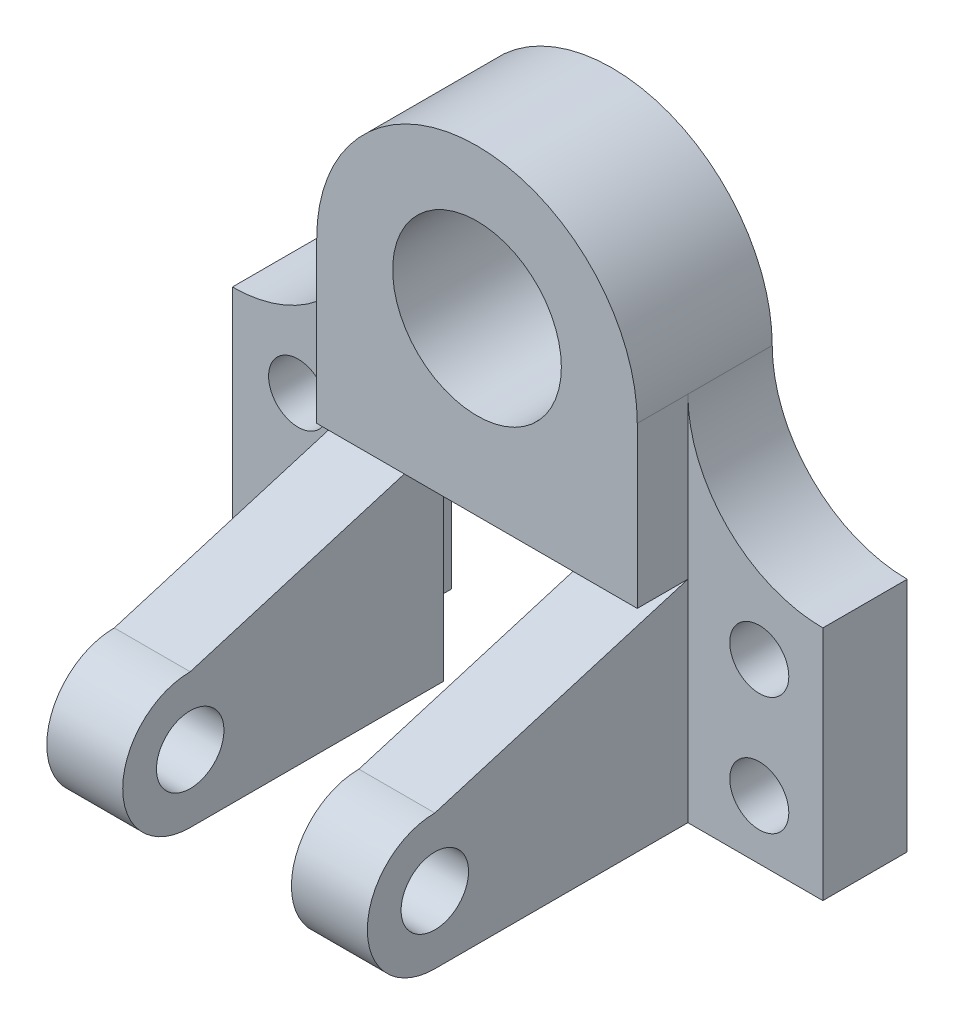
ISO-10303-21;
HEADER;
FILE_DESCRIPTION(('STEP AP214'),'2;1');
FILE_NAME('part.step','',(''),(''),'','','');
FILE_SCHEMA(('AUTOMOTIVE_DESIGN { 1 0 10303 214 1 1 1 1 }'));
ENDSEC;
DATA;
#1=APPLICATION_CONTEXT('core data for automotive mechanical design processes');
#2=APPLICATION_PROTOCOL_DEFINITION('international standard','automotive_design',2000,#1);
#3=PRODUCT_CONTEXT('',#1,'mechanical');
#4=PRODUCT('Part','Part','',(#3));
#5=PRODUCT_RELATED_PRODUCT_CATEGORY('part','',(#4));
#6=PRODUCT_DEFINITION_FORMATION('','',#4);
#7=PRODUCT_DEFINITION_CONTEXT('part definition',#1,'design');
#8=PRODUCT_DEFINITION('design','',#6,#7);
#9=PRODUCT_DEFINITION_SHAPE('','',#8);
#10=(LENGTH_UNIT() NAMED_UNIT(*) SI_UNIT(.MILLI.,.METRE.));
#11=(NAMED_UNIT(*) PLANE_ANGLE_UNIT() SI_UNIT($,.RADIAN.));
#12=(NAMED_UNIT(*) SI_UNIT($,.STERADIAN.) SOLID_ANGLE_UNIT());
#13=UNCERTAINTY_MEASURE_WITH_UNIT(LENGTH_MEASURE(1.E-05),#10,'distance_accuracy_value','');
#14=(GEOMETRIC_REPRESENTATION_CONTEXT(3) GLOBAL_UNCERTAINTY_ASSIGNED_CONTEXT((#13)) GLOBAL_UNIT_ASSIGNED_CONTEXT((#10,
#11,#12)) REPRESENTATION_CONTEXT('',''));
#15=CARTESIAN_POINT('',(0.,0.,0.));
#16=DIRECTION('',(0.,0.,1.));
#17=DIRECTION('',(1.,0.,0.));
#18=AXIS2_PLACEMENT_3D('',#15,#16,#17);
#19=CARTESIAN_POINT('',(20.,0.,20.));
#20=DIRECTION('',(0.,0.,1.));
#21=DIRECTION('',(1.,0.,0.));
#22=AXIS2_PLACEMENT_3D('',#19,#20,#21);
#23=PLANE('',#22);
#24=DIRECTION('',(0.,-1.,0.));
#25=VECTOR('',#24,1.);
#26=CARTESIAN_POINT('',(38.,0.,20.));
#27=LINE('',#26,#25);
#28=CARTESIAN_POINT('',(38.,0.,20.));
#29=VERTEX_POINT('',#28);
#30=CARTESIAN_POINT('',(38.,-50.,20.));
#31=VERTEX_POINT('',#30);
#32=EDGE_CURVE('E111',#29,#31,#27,.T.);
#33=ORIENTED_EDGE('',*,*,#32,.T.);
#34=DIRECTION('',(1.,0.,0.));
#35=VECTOR('',#34,1.);
#36=CARTESIAN_POINT('',(20.,-50.,20.));
#37=LINE('',#36,#35);
#38=CARTESIAN_POINT('',(20.,-50.,20.));
#39=VERTEX_POINT('',#38);
#40=EDGE_CURVE('E12',#39,#31,#37,.T.);
#41=ORIENTED_EDGE('',*,*,#40,.F.);
#42=DIRECTION('',(0.,-1.,0.));
#43=VECTOR('',#42,1.);
#44=CARTESIAN_POINT('',(20.,0.,20.));
#45=LINE('',#44,#43);
#46=CARTESIAN_POINT('',(20.,0.,20.));
#47=VERTEX_POINT('',#46);
#48=EDGE_CURVE('E98',#47,#39,#45,.T.);
#49=ORIENTED_EDGE('',*,*,#48,.F.);
#50=DIRECTION('',(1.,0.,0.));
#51=VECTOR('',#50,1.);
#52=CARTESIAN_POINT('',(20.,0.,20.));
#53=LINE('',#52,#51);
#54=EDGE_CURVE('E107',#47,#29,#53,.T.);
#55=ORIENTED_EDGE('',*,*,#54,.T.);
#56=EDGE_LOOP('',(#33,#41,#49,#55));
#57=FACE_BOUND('',#56,.T.);
#58=ADVANCED_FACE('F46',(#57),#23,.F.);
#59=CARTESIAN_POINT('',(20.,-50.,20.));
#60=DIRECTION('',(0.,1.,0.));
#61=DIRECTION('',(0.,0.,1.));
#62=AXIS2_PLACEMENT_3D('',#59,#60,#61);
#63=PLANE('',#62);
#64=DIRECTION('',(0.,0.,1.));
#65=VECTOR('',#64,1.);
#66=CARTESIAN_POINT('',(38.,-50.,20.));
#67=LINE('',#66,#65);
#68=CARTESIAN_POINT('',(38.,-50.,80.));
#69=VERTEX_POINT('',#68);
#70=EDGE_CURVE('E102',#31,#69,#67,.T.);
#71=ORIENTED_EDGE('',*,*,#70,.T.);
#72=DIRECTION('',(1.,0.,0.));
#73=VECTOR('',#72,1.);
#74=CARTESIAN_POINT('',(20.,-50.,80.));
#75=LINE('',#74,#73);
#76=CARTESIAN_POINT('',(20.,-50.,80.));
#77=VERTEX_POINT('',#76);
#78=EDGE_CURVE('E55',#77,#69,#75,.T.);
#79=ORIENTED_EDGE('',*,*,#78,.F.);
#80=DIRECTION('',(0.,0.,1.));
#81=VECTOR('',#80,1.);
#82=CARTESIAN_POINT('',(20.,-50.,20.));
#83=LINE('',#82,#81);
#84=EDGE_CURVE('E93',#39,#77,#83,.T.);
#85=ORIENTED_EDGE('',*,*,#84,.F.);
#86=ORIENTED_EDGE('',*,*,#40,.T.);
#87=EDGE_LOOP('',(#71,#79,#85,#86));
#88=FACE_BOUND('',#87,.T.);
#89=ADVANCED_FACE('F101',(#88),#63,.F.);
#90=CARTESIAN_POINT('',(20.,-34.,80.));
#91=DIRECTION('',(1.,0.,0.));
#92=DIRECTION('',(0.,0.,-1.));
#93=AXIS2_PLACEMENT_3D('',#90,#91,#92);
#94=CYLINDRICAL_SURFACE('',#93,16.);
#95=CARTESIAN_POINT('',(38.,-34.,80.));
#96=DIRECTION('',(-1.,0.,0.));
#97=DIRECTION('',(0.,0.,1.));
#98=AXIS2_PLACEMENT_3D('',#95,#96,#97);
#99=CIRCLE('',#98,16.);
#100=CARTESIAN_POINT('',(38.,-18.,80.));
#101=VERTEX_POINT('',#100);
#102=EDGE_CURVE('E80',#69,#101,#99,.T.);
#103=ORIENTED_EDGE('',*,*,#102,.T.);
#104=DIRECTION('',(1.,0.,0.));
#105=VECTOR('',#104,1.);
#106=CARTESIAN_POINT('',(20.,-18.,80.));
#107=LINE('',#106,#105);
#108=CARTESIAN_POINT('',(20.,-18.,80.));
#109=VERTEX_POINT('',#108);
#110=EDGE_CURVE('E103',#109,#101,#107,.T.);
#111=ORIENTED_EDGE('',*,*,#110,.F.);
#112=CARTESIAN_POINT('',(20.,-34.,80.));
#113=DIRECTION('',(-1.,0.,0.));
#114=DIRECTION('',(0.,0.,1.));
#115=AXIS2_PLACEMENT_3D('',#112,#113,#114);
#116=CIRCLE('',#115,16.);
#117=EDGE_CURVE('E96',#77,#109,#116,.T.);
#118=ORIENTED_EDGE('',*,*,#117,.F.);
#119=ORIENTED_EDGE('',*,*,#78,.T.);
#120=EDGE_LOOP('',(#103,#111,#118,#119));
#121=FACE_BOUND('',#120,.T.);
#122=ADVANCED_FACE('F105',(#121),#94,.T.);
#123=CARTESIAN_POINT('',(20.,0.,20.));
#124=DIRECTION('',(0.,-0.957826285221151,-0.287347885566346));
#125=DIRECTION('',(0.,0.287347885566346,-0.957826285221152));
#126=AXIS2_PLACEMENT_3D('',#123,#124,#125);
#127=PLANE('',#126);
#128=DIRECTION('',(0.,0.287347885566346,-0.957826285221151));
#129=VECTOR('',#128,1.);
#130=CARTESIAN_POINT('',(38.,0.,20.));
#131=LINE('',#130,#129);
#132=EDGE_CURVE('E86',#101,#29,#131,.T.);
#133=ORIENTED_EDGE('',*,*,#132,.T.);
#134=ORIENTED_EDGE('',*,*,#54,.F.);
#135=DIRECTION('',(0.,0.287347885566346,-0.957826285221151));
#136=VECTOR('',#135,1.);
#137=CARTESIAN_POINT('',(20.,0.,20.));
#138=LINE('',#137,#136);
#139=EDGE_CURVE('E63',#109,#47,#138,.T.);
#140=ORIENTED_EDGE('',*,*,#139,.F.);
#141=ORIENTED_EDGE('',*,*,#110,.T.);
#142=EDGE_LOOP('',(#133,#134,#140,#141));
#143=FACE_BOUND('',#142,.T.);
#144=ADVANCED_FACE('F119',(#143),#127,.F.);
#145=CARTESIAN_POINT('',(20.,-34.,80.));
#146=DIRECTION('',(-1.,0.,0.));
#147=DIRECTION('',(0.,0.,1.));
#148=AXIS2_PLACEMENT_3D('',#145,#146,#147);
#149=PLANE('',#148);
#150=CARTESIAN_POINT('',(20.,-33.9996164173377,80.));
#151=DIRECTION('',(-1.,0.,0.));
#152=DIRECTION('',(0.,0.,1.));
#153=AXIS2_PLACEMENT_3D('',#150,#151,#152);
#154=CIRCLE('',#153,8.00000000000001);
#155=CARTESIAN_POINT('',(20.,-33.9996164173377,88.));
#156=VERTEX_POINT('',#155);
#157=EDGE_CURVE('E114',#156,#156,#154,.T.);
#158=ORIENTED_EDGE('',*,*,#157,.F.);
#159=EDGE_LOOP('',(#158));
#160=FACE_BOUND('',#159,.T.);
#161=ORIENTED_EDGE('',*,*,#48,.T.);
#162=ORIENTED_EDGE('',*,*,#84,.T.);
#163=ORIENTED_EDGE('',*,*,#117,.T.);
#164=ORIENTED_EDGE('',*,*,#139,.T.);
#165=EDGE_LOOP('',(#161,#162,#163,#164));
#166=FACE_BOUND('',#165,.T.);
#167=ADVANCED_FACE('F94',(#160,#166),#149,.T.);
#168=CARTESIAN_POINT('',(38.,-34.,80.));
#169=DIRECTION('',(-1.,0.,0.));
#170=DIRECTION('',(0.,0.,1.));
#171=AXIS2_PLACEMENT_3D('',#168,#169,#170);
#172=PLANE('',#171);
#173=CARTESIAN_POINT('',(38.,-33.9996164173377,80.));
#174=DIRECTION('',(-1.,0.,0.));
#175=DIRECTION('',(0.,0.,1.));
#176=AXIS2_PLACEMENT_3D('',#173,#174,#175);
#177=CIRCLE('',#176,8.00000000000001);
#178=CARTESIAN_POINT('',(38.,-33.9996164173377,88.));
#179=VERTEX_POINT('',#178);
#180=EDGE_CURVE('E49',#179,#179,#177,.T.);
#181=ORIENTED_EDGE('',*,*,#180,.T.);
#182=EDGE_LOOP('',(#181));
#183=FACE_BOUND('',#182,.T.);
#184=ORIENTED_EDGE('',*,*,#32,.F.);
#185=ORIENTED_EDGE('',*,*,#132,.F.);
#186=ORIENTED_EDGE('',*,*,#102,.F.);
#187=ORIENTED_EDGE('',*,*,#70,.F.);
#188=EDGE_LOOP('',(#184,#185,#186,#187));
#189=FACE_BOUND('',#188,.T.);
#190=ADVANCED_FACE('F122',(#183,#189),#172,.F.);
#191=CARTESIAN_POINT('',(70.0000000000001,-33.9996164173376,80.));
#192=DIRECTION('',(-1.,0.,0.));
#193=DIRECTION('',(0.,-1.,0.));
#194=AXIS2_PLACEMENT_3D('',#191,#192,#193);
#195=CYLINDRICAL_SURFACE('',#194,8.00000000000001);
#196=ORIENTED_EDGE('',*,*,#157,.T.);
#197=EDGE_LOOP('',(#196));
#198=FACE_BOUND('',#197,.T.);
#199=ORIENTED_EDGE('',*,*,#180,.F.);
#200=EDGE_LOOP('',(#199));
#201=FACE_BOUND('',#200,.T.);
#202=ADVANCED_FACE('F132',(#198,#201),#195,.F.);
#203=CLOSED_SHELL('',(#58,#89,#122,#144,#167,#190,#202));
#204=MANIFOLD_SOLID_BREP('B2',#203);
#205=CARTESIAN_POINT('',(-20.,0.,20.));
#206=DIRECTION('',(0.,0.,1.));
#207=DIRECTION('',(0.,-1.,0.));
#208=AXIS2_PLACEMENT_3D('',#205,#206,#207);
#209=PLANE('',#208);
#210=DIRECTION('',(0.,1.,0.));
#211=VECTOR('',#210,1.);
#212=CARTESIAN_POINT('',(-38.,0.,20.));
#213=LINE('',#212,#211);
#214=CARTESIAN_POINT('',(-38.,-50.,20.));
#215=VERTEX_POINT('',#214);
#216=CARTESIAN_POINT('',(-38.,0.,20.));
#217=VERTEX_POINT('',#216);
#218=EDGE_CURVE('E263',#215,#217,#213,.T.);
#219=ORIENTED_EDGE('',*,*,#218,.T.);
#220=DIRECTION('',(-1.,0.,0.));
#221=VECTOR('',#220,1.);
#222=CARTESIAN_POINT('',(-20.,0.,20.));
#223=LINE('',#222,#221);
#224=CARTESIAN_POINT('',(-20.,0.,20.));
#225=VERTEX_POINT('',#224);
#226=EDGE_CURVE('E44',#225,#217,#223,.T.);
#227=ORIENTED_EDGE('',*,*,#226,.F.);
#228=DIRECTION('',(0.,1.,0.));
#229=VECTOR('',#228,1.);
#230=CARTESIAN_POINT('',(-20.,0.,20.));
#231=LINE('',#230,#229);
#232=CARTESIAN_POINT('',(-20.,-50.,20.));
#233=VERTEX_POINT('',#232);
#234=EDGE_CURVE('E251',#233,#225,#231,.T.);
#235=ORIENTED_EDGE('',*,*,#234,.F.);
#236=DIRECTION('',(-1.,0.,0.));
#237=VECTOR('',#236,1.);
#238=CARTESIAN_POINT('',(-20.,-50.,20.));
#239=LINE('',#238,#237);
#240=EDGE_CURVE('E259',#233,#215,#239,.T.);
#241=ORIENTED_EDGE('',*,*,#240,.T.);
#242=EDGE_LOOP('',(#219,#227,#235,#241));
#243=FACE_BOUND('',#242,.T.);
#244=ADVANCED_FACE('F200',(#243),#209,.F.);
#245=CARTESIAN_POINT('',(-20.,-18.,80.));
#246=DIRECTION('',(0.,-0.957826285221151,-0.287347885566346));
#247=DIRECTION('',(0.,0.287347885566346,-0.957826285221152));
#248=AXIS2_PLACEMENT_3D('',#245,#246,#247);
#249=PLANE('',#248);
#250=DIRECTION('',(0.,-0.287347885566346,0.957826285221151));
#251=VECTOR('',#250,1.);
#252=CARTESIAN_POINT('',(-38.,-18.,80.));
#253=LINE('',#252,#251);
#254=CARTESIAN_POINT('',(-38.,-18.,80.));
#255=VERTEX_POINT('',#254);
#256=EDGE_CURVE('E255',#217,#255,#253,.T.);
#257=ORIENTED_EDGE('',*,*,#256,.T.);
#258=DIRECTION('',(-1.,0.,0.));
#259=VECTOR('',#258,1.);
#260=CARTESIAN_POINT('',(-20.,-18.,80.));
#261=LINE('',#260,#259);
#262=CARTESIAN_POINT('',(-20.,-18.,80.));
#263=VERTEX_POINT('',#262);
#264=EDGE_CURVE('E208',#263,#255,#261,.T.);
#265=ORIENTED_EDGE('',*,*,#264,.F.);
#266=DIRECTION('',(0.,-0.287347885566346,0.957826285221151));
#267=VECTOR('',#266,1.);
#268=CARTESIAN_POINT('',(-20.,-18.,80.));
#269=LINE('',#268,#267);
#270=EDGE_CURVE('E246',#225,#263,#269,.T.);
#271=ORIENTED_EDGE('',*,*,#270,.F.);
#272=ORIENTED_EDGE('',*,*,#226,.T.);
#273=EDGE_LOOP('',(#257,#265,#271,#272));
#274=FACE_BOUND('',#273,.T.);
#275=ADVANCED_FACE('F254',(#274),#249,.F.);
#276=CARTESIAN_POINT('',(-20.,-34.,80.));
#277=DIRECTION('',(-1.,0.,0.));
#278=DIRECTION('',(0.,-1.,0.));
#279=AXIS2_PLACEMENT_3D('',#276,#277,#278);
#280=CYLINDRICAL_SURFACE('',#279,16.);
#281=CARTESIAN_POINT('',(-38.,-34.,80.));
#282=DIRECTION('',(1.,0.,0.));
#283=DIRECTION('',(0.,-1.,0.));
#284=AXIS2_PLACEMENT_3D('',#281,#282,#283);
#285=CIRCLE('',#284,16.);
#286=CARTESIAN_POINT('',(-38.,-50.,80.));
#287=VERTEX_POINT('',#286);
#288=EDGE_CURVE('E233',#255,#287,#285,.T.);
#289=ORIENTED_EDGE('',*,*,#288,.T.);
#290=DIRECTION('',(-1.,0.,0.));
#291=VECTOR('',#290,1.);
#292=CARTESIAN_POINT('',(-20.,-50.,80.));
#293=LINE('',#292,#291);
#294=CARTESIAN_POINT('',(-20.,-50.,80.));
#295=VERTEX_POINT('',#294);
#296=EDGE_CURVE('E256',#295,#287,#293,.T.);
#297=ORIENTED_EDGE('',*,*,#296,.F.);
#298=CARTESIAN_POINT('',(-20.,-34.,80.));
#299=DIRECTION('',(1.,0.,0.));
#300=DIRECTION('',(0.,-1.,0.));
#301=AXIS2_PLACEMENT_3D('',#298,#299,#300);
#302=CIRCLE('',#301,16.);
#303=EDGE_CURVE('E249',#263,#295,#302,.T.);
#304=ORIENTED_EDGE('',*,*,#303,.F.);
#305=ORIENTED_EDGE('',*,*,#264,.T.);
#306=EDGE_LOOP('',(#289,#297,#304,#305));
#307=FACE_BOUND('',#306,.T.);
#308=ADVANCED_FACE('F257',(#307),#280,.T.);
#309=CARTESIAN_POINT('',(-20.,-50.,20.));
#310=DIRECTION('',(0.,1.,0.));
#311=DIRECTION('',(-1.,0.,0.));
#312=AXIS2_PLACEMENT_3D('',#309,#310,#311);
#313=PLANE('',#312);
#314=DIRECTION('',(0.,0.,-1.));
#315=VECTOR('',#314,1.);
#316=CARTESIAN_POINT('',(-38.,-50.,20.));
#317=LINE('',#316,#315);
#318=EDGE_CURVE('E239',#287,#215,#317,.T.);
#319=ORIENTED_EDGE('',*,*,#318,.T.);
#320=ORIENTED_EDGE('',*,*,#240,.F.);
#321=DIRECTION('',(0.,0.,-1.));
#322=VECTOR('',#321,1.);
#323=CARTESIAN_POINT('',(-20.,-50.,20.));
#324=LINE('',#323,#322);
#325=EDGE_CURVE('E216',#295,#233,#324,.T.);
#326=ORIENTED_EDGE('',*,*,#325,.F.);
#327=ORIENTED_EDGE('',*,*,#296,.T.);
#328=EDGE_LOOP('',(#319,#320,#326,#327));
#329=FACE_BOUND('',#328,.T.);
#330=ADVANCED_FACE('F271',(#329),#313,.F.);
#331=CARTESIAN_POINT('',(-20.,-34.,80.));
#332=DIRECTION('',(-1.,0.,0.));
#333=DIRECTION('',(0.,-1.,0.));
#334=AXIS2_PLACEMENT_3D('',#331,#332,#333);
#335=PLANE('',#334);
#336=CARTESIAN_POINT('',(-20.,-33.9996164173377,80.));
#337=DIRECTION('',(-1.,0.,0.));
#338=DIRECTION('',(0.,-1.,0.));
#339=AXIS2_PLACEMENT_3D('',#336,#337,#338);
#340=CIRCLE('',#339,8.00000000000001);
#341=CARTESIAN_POINT('',(-20.,-41.9996164173377,80.));
#342=VERTEX_POINT('',#341);
#343=EDGE_CURVE('E266',#342,#342,#340,.T.);
#344=ORIENTED_EDGE('',*,*,#343,.T.);
#345=EDGE_LOOP('',(#344));
#346=FACE_BOUND('',#345,.T.);
#347=ORIENTED_EDGE('',*,*,#234,.T.);
#348=ORIENTED_EDGE('',*,*,#270,.T.);
#349=ORIENTED_EDGE('',*,*,#303,.T.);
#350=ORIENTED_EDGE('',*,*,#325,.T.);
#351=EDGE_LOOP('',(#347,#348,#349,#350));
#352=FACE_BOUND('',#351,.T.);
#353=ADVANCED_FACE('F247',(#346,#352),#335,.F.);
#354=CARTESIAN_POINT('',(-38.,-34.,80.));
#355=DIRECTION('',(-1.,0.,0.));
#356=DIRECTION('',(0.,-1.,0.));
#357=AXIS2_PLACEMENT_3D('',#354,#355,#356);
#358=PLANE('',#357);
#359=CARTESIAN_POINT('',(-38.,-33.9996164173377,80.));
#360=DIRECTION('',(-1.,0.,0.));
#361=DIRECTION('',(0.,-1.,0.));
#362=AXIS2_PLACEMENT_3D('',#359,#360,#361);
#363=CIRCLE('',#362,8.00000000000001);
#364=CARTESIAN_POINT('',(-38.,-41.9996164173377,80.));
#365=VERTEX_POINT('',#364);
#366=EDGE_CURVE('E279',#365,#365,#363,.T.);
#367=ORIENTED_EDGE('',*,*,#366,.F.);
#368=EDGE_LOOP('',(#367));
#369=FACE_BOUND('',#368,.T.);
#370=ORIENTED_EDGE('',*,*,#218,.F.);
#371=ORIENTED_EDGE('',*,*,#318,.F.);
#372=ORIENTED_EDGE('',*,*,#288,.F.);
#373=ORIENTED_EDGE('',*,*,#256,.F.);
#374=EDGE_LOOP('',(#370,#371,#372,#373));
#375=FACE_BOUND('',#374,.T.);
#376=ADVANCED_FACE('F274',(#369,#375),#358,.T.);
#377=CARTESIAN_POINT('',(70.0000000000001,-33.9996164173376,80.));
#378=DIRECTION('',(-1.,0.,0.));
#379=DIRECTION('',(0.,-1.,0.));
#380=AXIS2_PLACEMENT_3D('',#377,#378,#379);
#381=CYLINDRICAL_SURFACE('',#380,8.00000000000001);
#382=ORIENTED_EDGE('',*,*,#366,.T.);
#383=EDGE_LOOP('',(#382));
#384=FACE_BOUND('',#383,.T.);
#385=ORIENTED_EDGE('',*,*,#343,.F.);
#386=EDGE_LOOP('',(#385));
#387=FACE_BOUND('',#386,.T.);
#388=ADVANCED_FACE('F283',(#384,#387),#381,.F.);
#389=CLOSED_SHELL('',(#244,#275,#308,#330,#353,#376,#388));
#390=MANIFOLD_SOLID_BREP('B6',#389);
#391=CARTESIAN_POINT('',(0.,38.,32.));
#392=DIRECTION('',(0.,0.,-1.));
#393=DIRECTION('',(-1.,0.,0.));
#394=AXIS2_PLACEMENT_3D('',#391,#392,#393);
#395=CYLINDRICAL_SURFACE('',#394,38.);
#396=CARTESIAN_POINT('',(0.,38.,0.));
#397=DIRECTION('',(0.,0.,1.));
#398=DIRECTION('',(1.,0.,0.));
#399=AXIS2_PLACEMENT_3D('',#396,#397,#398);
#400=CIRCLE('',#399,38.);
#401=CARTESIAN_POINT('',(-38.,38.,0.));
#402=VERTEX_POINT('',#401);
#403=CARTESIAN_POINT('',(38.,38.,0.));
#404=VERTEX_POINT('',#403);
#405=EDGE_CURVE('E513',#402,#404,#400,.F.);
#406=ORIENTED_EDGE('',*,*,#405,.F.);
#407=DIRECTION('',(0.,0.,-1.));
#408=VECTOR('',#407,1.);
#409=CARTESIAN_POINT('',(-38.,38.,20.));
#410=LINE('',#409,#408);
#411=CARTESIAN_POINT('',(-38.,38.,20.));
#412=VERTEX_POINT('',#411);
#413=EDGE_CURVE('E507',#412,#402,#410,.T.);
#414=ORIENTED_EDGE('',*,*,#413,.F.);
#415=DIRECTION('',(0.,0.,-1.));
#416=VECTOR('',#415,1.);
#417=CARTESIAN_POINT('',(-38.,38.,32.));
#418=LINE('',#417,#416);
#419=CARTESIAN_POINT('',(-38.,38.,32.));
#420=VERTEX_POINT('',#419);
#421=EDGE_CURVE('E198',#420,#412,#418,.T.);
#422=ORIENTED_EDGE('',*,*,#421,.F.);
#423=CARTESIAN_POINT('',(0.,38.,32.));
#424=DIRECTION('',(0.,0.,1.));
#425=DIRECTION('',(1.,0.,0.));
#426=AXIS2_PLACEMENT_3D('',#423,#424,#425);
#427=CIRCLE('',#426,38.);
#428=CARTESIAN_POINT('',(38.,38.,32.));
#429=VERTEX_POINT('',#428);
#430=EDGE_CURVE('E514',#420,#429,#427,.F.);
#431=ORIENTED_EDGE('',*,*,#430,.T.);
#432=DIRECTION('',(0.,0.,-1.));
#433=VECTOR('',#432,1.);
#434=CARTESIAN_POINT('',(38.,38.,32.));
#435=LINE('',#434,#433);
#436=CARTESIAN_POINT('',(38.,38.,20.));
#437=VERTEX_POINT('',#436);
#438=EDGE_CURVE('E524',#429,#437,#435,.T.);
#439=ORIENTED_EDGE('',*,*,#438,.T.);
#440=DIRECTION('',(0.,0.,-1.));
#441=VECTOR('',#440,1.);
#442=CARTESIAN_POINT('',(38.,38.,20.));
#443=LINE('',#442,#441);
#444=EDGE_CURVE('E445',#437,#404,#443,.T.);
#445=ORIENTED_EDGE('',*,*,#444,.T.);
#446=EDGE_LOOP('',(#406,#414,#422,#431,#439,#445));
#447=FACE_BOUND('',#446,.T.);
#448=ADVANCED_FACE('F345',(#447),#395,.T.);
#449=CARTESIAN_POINT('',(-38.,0.,32.));
#450=DIRECTION('',(1.,0.,0.));
#451=DIRECTION('',(0.,1.,0.));
#452=AXIS2_PLACEMENT_3D('',#449,#450,#451);
#453=PLANE('',#452);
#454=ORIENTED_EDGE('',*,*,#421,.T.);
#455=DIRECTION('',(0.,-1.,0.));
#456=VECTOR('',#455,1.);
#457=CARTESIAN_POINT('',(-38.,0.,20.));
#458=LINE('',#457,#456);
#459=CARTESIAN_POINT('',(-38.,0.,20.));
#460=VERTEX_POINT('',#459);
#461=EDGE_CURVE('E480',#412,#460,#458,.T.);
#462=ORIENTED_EDGE('',*,*,#461,.T.);
#463=DIRECTION('',(0.,0.,-1.));
#464=VECTOR('',#463,1.);
#465=CARTESIAN_POINT('',(-38.,0.,32.));
#466=LINE('',#465,#464);
#467=CARTESIAN_POINT('',(-38.,0.,32.));
#468=VERTEX_POINT('',#467);
#469=EDGE_CURVE('E352',#468,#460,#466,.T.);
#470=ORIENTED_EDGE('',*,*,#469,.F.);
#471=DIRECTION('',(0.,-1.,0.));
#472=VECTOR('',#471,1.);
#473=CARTESIAN_POINT('',(-38.,0.,32.));
#474=LINE('',#473,#472);
#475=EDGE_CURVE('E517',#420,#468,#474,.T.);
#476=ORIENTED_EDGE('',*,*,#475,.F.);
#477=EDGE_LOOP('',(#454,#462,#470,#476));
#478=FACE_BOUND('',#477,.T.);
#479=ADVANCED_FACE('F610',(#478),#453,.F.);
#480=CARTESIAN_POINT('',(0.,0.,32.));
#481=DIRECTION('',(0.,1.,0.));
#482=DIRECTION('',(-1.,0.,0.));
#483=AXIS2_PLACEMENT_3D('',#480,#481,#482);
#484=PLANE('',#483);
#485=ORIENTED_EDGE('',*,*,#469,.T.);
#486=DIRECTION('',(0.,0.,-1.));
#487=VECTOR('',#486,1.);
#488=CARTESIAN_POINT('',(-38.,0.,32.));
#489=LINE('',#488,#487);
#490=CARTESIAN_POINT('',(-38.,0.,0.));
#491=VERTEX_POINT('',#490);
#492=EDGE_CURVE('E510',#460,#491,#489,.T.);
#493=ORIENTED_EDGE('',*,*,#492,.T.);
#494=DIRECTION('',(1.,0.,0.));
#495=VECTOR('',#494,1.);
#496=CARTESIAN_POINT('',(0.,0.,0.));
#497=LINE('',#496,#495);
#498=CARTESIAN_POINT('',(38.,0.,0.));
#499=VERTEX_POINT('',#498);
#500=EDGE_CURVE('E518',#491,#499,#497,.T.);
#501=ORIENTED_EDGE('',*,*,#500,.T.);
#502=DIRECTION('',(0.,0.,1.));
#503=VECTOR('',#502,1.);
#504=CARTESIAN_POINT('',(38.,0.,32.));
#505=LINE('',#504,#503);
#506=CARTESIAN_POINT('',(38.,0.,20.));
#507=VERTEX_POINT('',#506);
#508=EDGE_CURVE('E359',#499,#507,#505,.T.);
#509=ORIENTED_EDGE('',*,*,#508,.T.);
#510=DIRECTION('',(0.,0.,-1.));
#511=VECTOR('',#510,1.);
#512=CARTESIAN_POINT('',(38.,0.,32.));
#513=LINE('',#512,#511);
#514=CARTESIAN_POINT('',(38.,0.,32.));
#515=VERTEX_POINT('',#514);
#516=EDGE_CURVE('E528',#515,#507,#513,.T.);
#517=ORIENTED_EDGE('',*,*,#516,.F.);
#518=DIRECTION('',(1.,0.,0.));
#519=VECTOR('',#518,1.);
#520=CARTESIAN_POINT('',(0.,0.,32.));
#521=LINE('',#520,#519);
#522=EDGE_CURVE('E520',#468,#515,#521,.T.);
#523=ORIENTED_EDGE('',*,*,#522,.F.);
#524=EDGE_LOOP('',(#485,#493,#501,#509,#517,#523));
#525=FACE_BOUND('',#524,.T.);
#526=ADVANCED_FACE('F533',(#525),#484,.F.);
#527=CARTESIAN_POINT('',(38.,0.,32.));
#528=DIRECTION('',(-1.,0.,0.));
#529=DIRECTION('',(0.,0.,1.));
#530=AXIS2_PLACEMENT_3D('',#527,#528,#529);
#531=PLANE('',#530);
#532=ORIENTED_EDGE('',*,*,#516,.T.);
#533=DIRECTION('',(0.,1.,0.));
#534=VECTOR('',#533,1.);
#535=CARTESIAN_POINT('',(38.,0.,20.));
#536=LINE('',#535,#534);
#537=EDGE_CURVE('E366',#507,#437,#536,.T.);
#538=ORIENTED_EDGE('',*,*,#537,.T.);
#539=ORIENTED_EDGE('',*,*,#438,.F.);
#540=DIRECTION('',(0.,1.,0.));
#541=VECTOR('',#540,1.);
#542=CARTESIAN_POINT('',(38.,0.,32.));
#543=LINE('',#542,#541);
#544=EDGE_CURVE('E522',#515,#429,#543,.T.);
#545=ORIENTED_EDGE('',*,*,#544,.F.);
#546=EDGE_LOOP('',(#532,#538,#539,#545));
#547=FACE_BOUND('',#546,.T.);
#548=ADVANCED_FACE('F604',(#547),#531,.F.);
#549=CARTESIAN_POINT('',(0.,0.,32.));
#550=DIRECTION('',(0.,0.,1.));
#551=DIRECTION('',(1.,0.,0.));
#552=AXIS2_PLACEMENT_3D('',#549,#550,#551);
#553=PLANE('',#552);
#554=CARTESIAN_POINT('',(0.,40.5505160485282,32.));
#555=DIRECTION('',(0.,0.,1.));
#556=DIRECTION('',(1.,0.,0.));
#557=AXIS2_PLACEMENT_3D('',#554,#555,#556);
#558=CIRCLE('',#557,20.);
#559=CARTESIAN_POINT('',(20.,40.5505160485282,32.));
#560=VERTEX_POINT('',#559);
#561=EDGE_CURVE('E586',#560,#560,#558,.T.);
#562=ORIENTED_EDGE('',*,*,#561,.F.);
#563=EDGE_LOOP('',(#562));
#564=FACE_BOUND('',#563,.T.);
#565=ORIENTED_EDGE('',*,*,#430,.F.);
#566=ORIENTED_EDGE('',*,*,#475,.T.);
#567=ORIENTED_EDGE('',*,*,#522,.T.);
#568=ORIENTED_EDGE('',*,*,#544,.T.);
#569=EDGE_LOOP('',(#565,#566,#567,#568));
#570=FACE_BOUND('',#569,.T.);
#571=ADVANCED_FACE('F601',(#564,#570),#553,.T.);
#572=CARTESIAN_POINT('',(0.,0.,0.));
#573=DIRECTION('',(0.,0.,1.));
#574=DIRECTION('',(1.,0.,0.));
#575=AXIS2_PLACEMENT_3D('',#572,#573,#574);
#576=PLANE('',#575);
#577=CARTESIAN_POINT('',(0.,40.5505160485282,0.));
#578=DIRECTION('',(0.,0.,1.));
#579=DIRECTION('',(1.,0.,0.));
#580=AXIS2_PLACEMENT_3D('',#577,#578,#579);
#581=CIRCLE('',#580,20.);
#582=CARTESIAN_POINT('',(20.,40.5505160485282,0.));
#583=VERTEX_POINT('',#582);
#584=EDGE_CURVE('E583',#583,#583,#581,.T.);
#585=ORIENTED_EDGE('',*,*,#584,.T.);
#586=EDGE_LOOP('',(#585));
#587=FACE_BOUND('',#586,.T.);
#588=CARTESIAN_POINT('',(-54.414414874663,-36.,0.));
#589=DIRECTION('',(0.,0.,1.));
#590=DIRECTION('',(1.,0.,0.));
#591=AXIS2_PLACEMENT_3D('',#588,#589,#590);
#592=CIRCLE('',#591,7.);
#593=CARTESIAN_POINT('',(-47.414414874663,-36.,0.));
#594=VERTEX_POINT('',#593);
#595=EDGE_CURVE('E565',#594,#594,#592,.T.);
#596=ORIENTED_EDGE('',*,*,#595,.T.);
#597=EDGE_LOOP('',(#596));
#598=FACE_BOUND('',#597,.T.);
#599=CARTESIAN_POINT('',(54.9293777914579,-7.99999999999999,0.));
#600=DIRECTION('',(0.,0.,1.));
#601=DIRECTION('',(1.,0.,0.));
#602=AXIS2_PLACEMENT_3D('',#599,#600,#601);
#603=CIRCLE('',#602,7.);
#604=CARTESIAN_POINT('',(61.9293777914579,-7.99999999999999,0.));
#605=VERTEX_POINT('',#604);
#606=EDGE_CURVE('E571',#605,#605,#603,.T.);
#607=ORIENTED_EDGE('',*,*,#606,.T.);
#608=EDGE_LOOP('',(#607));
#609=FACE_BOUND('',#608,.T.);
#610=CARTESIAN_POINT('',(54.9293777914579,-36.,0.));
#611=DIRECTION('',(0.,0.,1.));
#612=DIRECTION('',(1.,0.,0.));
#613=AXIS2_PLACEMENT_3D('',#610,#611,#612);
#614=CIRCLE('',#613,7.);
#615=CARTESIAN_POINT('',(61.9293777914579,-36.,0.));
#616=VERTEX_POINT('',#615);
#617=EDGE_CURVE('E572',#616,#616,#614,.T.);
#618=ORIENTED_EDGE('',*,*,#617,.T.);
#619=EDGE_LOOP('',(#618));
#620=FACE_BOUND('',#619,.T.);
#621=CARTESIAN_POINT('',(-54.414414874663,-7.99999999999999,0.));
#622=DIRECTION('',(0.,0.,1.));
#623=DIRECTION('',(1.,0.,0.));
#624=AXIS2_PLACEMENT_3D('',#621,#622,#623);
#625=CIRCLE('',#624,7.);
#626=CARTESIAN_POINT('',(-47.414414874663,-7.99999999999999,0.));
#627=VERTEX_POINT('',#626);
#628=EDGE_CURVE('E466',#627,#627,#625,.T.);
#629=ORIENTED_EDGE('',*,*,#628,.T.);
#630=EDGE_LOOP('',(#629));
#631=FACE_BOUND('',#630,.T.);
#632=ORIENTED_EDGE('',*,*,#405,.T.);
#633=CARTESIAN_POINT('',(70.,38.,0.));
#634=DIRECTION('',(0.,0.,1.));
#635=DIRECTION('',(1.,0.,0.));
#636=AXIS2_PLACEMENT_3D('',#633,#634,#635);
#637=CIRCLE('',#636,32.);
#638=CARTESIAN_POINT('',(70.,6.00000000000001,0.));
#639=VERTEX_POINT('',#638);
#640=EDGE_CURVE('E463',#404,#639,#637,.T.);
#641=ORIENTED_EDGE('',*,*,#640,.T.);
#642=DIRECTION('',(0.,-1.,0.));
#643=VECTOR('',#642,1.);
#644=CARTESIAN_POINT('',(70.,0.,0.));
#645=LINE('',#644,#643);
#646=CARTESIAN_POINT('',(70.,-50.,0.));
#647=VERTEX_POINT('',#646);
#648=EDGE_CURVE('E470',#639,#647,#645,.T.);
#649=ORIENTED_EDGE('',*,*,#648,.T.);
#650=DIRECTION('',(-1.,0.,0.));
#651=VECTOR('',#650,1.);
#652=CARTESIAN_POINT('',(0.,-50.,0.));
#653=LINE('',#652,#651);
#654=CARTESIAN_POINT('',(38.,-50.,0.));
#655=VERTEX_POINT('',#654);
#656=EDGE_CURVE('E468',#647,#655,#653,.T.);
#657=ORIENTED_EDGE('',*,*,#656,.T.);
#658=DIRECTION('',(0.,1.,0.));
#659=VECTOR('',#658,1.);
#660=CARTESIAN_POINT('',(38.,0.,0.));
#661=LINE('',#660,#659);
#662=EDGE_CURVE('E440',#655,#499,#661,.T.);
#663=ORIENTED_EDGE('',*,*,#662,.T.);
#664=ORIENTED_EDGE('',*,*,#500,.F.);
#665=DIRECTION('',(0.,-1.,0.));
#666=VECTOR('',#665,1.);
#667=CARTESIAN_POINT('',(-38.,0.,0.));
#668=LINE('',#667,#666);
#669=CARTESIAN_POINT('',(-38.,-50.,0.));
#670=VERTEX_POINT('',#669);
#671=EDGE_CURVE('E479',#491,#670,#668,.T.);
#672=ORIENTED_EDGE('',*,*,#671,.T.);
#673=DIRECTION('',(1.,0.,0.));
#674=VECTOR('',#673,1.);
#675=CARTESIAN_POINT('',(0.,-50.,0.));
#676=LINE('',#675,#674);
#677=CARTESIAN_POINT('',(-70.,-50.,0.));
#678=VERTEX_POINT('',#677);
#679=EDGE_CURVE('E496',#678,#670,#676,.T.);
#680=ORIENTED_EDGE('',*,*,#679,.F.);
#681=DIRECTION('',(0.,-1.,0.));
#682=VECTOR('',#681,1.);
#683=CARTESIAN_POINT('',(-70.,0.,0.));
#684=LINE('',#683,#682);
#685=CARTESIAN_POINT('',(-70.,6.00000000000001,0.));
#686=VERTEX_POINT('',#685);
#687=EDGE_CURVE('E494',#686,#678,#684,.T.);
#688=ORIENTED_EDGE('',*,*,#687,.F.);
#689=CARTESIAN_POINT('',(-70.,38.,0.));
#690=DIRECTION('',(0.,0.,1.));
#691=DIRECTION('',(1.,0.,0.));
#692=AXIS2_PLACEMENT_3D('',#689,#690,#691);
#693=CIRCLE('',#692,32.);
#694=EDGE_CURVE('E492',#402,#686,#693,.F.);
#695=ORIENTED_EDGE('',*,*,#694,.F.);
#696=EDGE_LOOP('',(#632,#641,#649,#657,#663,#664,#672,#680,#688,#695));
#697=FACE_BOUND('',#696,.T.);
#698=ADVANCED_FACE('F552',(#587,#598,#609,#620,#631,#697),#576,.F.);
#699=CARTESIAN_POINT('',(-38.,0.,20.));
#700=DIRECTION('',(1.,0.,0.));
#701=DIRECTION('',(0.,1.,0.));
#702=AXIS2_PLACEMENT_3D('',#699,#700,#701);
#703=PLANE('',#702);
#704=ORIENTED_EDGE('',*,*,#492,.F.);
#705=CARTESIAN_POINT('',(-38.,-50.,20.));
#706=VERTEX_POINT('',#705);
#707=EDGE_CURVE('E483',#460,#706,#458,.T.);
#708=ORIENTED_EDGE('',*,*,#707,.T.);
#709=DIRECTION('',(0.,0.,-1.));
#710=VECTOR('',#709,1.);
#711=CARTESIAN_POINT('',(-38.,-50.,20.));
#712=LINE('',#711,#710);
#713=EDGE_CURVE('E490',#706,#670,#712,.T.);
#714=ORIENTED_EDGE('',*,*,#713,.T.);
#715=ORIENTED_EDGE('',*,*,#671,.F.);
#716=EDGE_LOOP('',(#704,#708,#714,#715));
#717=FACE_BOUND('',#716,.T.);
#718=ADVANCED_FACE('F539',(#717),#703,.T.);
#719=CARTESIAN_POINT('',(-70.,38.,20.));
#720=DIRECTION('',(0.,0.,-1.));
#721=DIRECTION('',(-1.,0.,0.));
#722=AXIS2_PLACEMENT_3D('',#719,#720,#721);
#723=CYLINDRICAL_SURFACE('',#722,32.);
#724=ORIENTED_EDGE('',*,*,#694,.T.);
#725=DIRECTION('',(0.,0.,-1.));
#726=VECTOR('',#725,1.);
#727=CARTESIAN_POINT('',(-70.,6.00000000000001,20.));
#728=LINE('',#727,#726);
#729=CARTESIAN_POINT('',(-70.,6.00000000000001,20.));
#730=VERTEX_POINT('',#729);
#731=EDGE_CURVE('E504',#730,#686,#728,.T.);
#732=ORIENTED_EDGE('',*,*,#731,.F.);
#733=CARTESIAN_POINT('',(-70.,38.,20.));
#734=DIRECTION('',(0.,0.,1.));
#735=DIRECTION('',(1.,0.,0.));
#736=AXIS2_PLACEMENT_3D('',#733,#734,#735);
#737=CIRCLE('',#736,32.);
#738=EDGE_CURVE('E482',#412,#730,#737,.F.);
#739=ORIENTED_EDGE('',*,*,#738,.F.);
#740=ORIENTED_EDGE('',*,*,#413,.T.);
#741=EDGE_LOOP('',(#724,#732,#739,#740));
#742=FACE_BOUND('',#741,.T.);
#743=ADVANCED_FACE('F624',(#742),#723,.F.);
#744=CARTESIAN_POINT('',(-70.,0.,20.));
#745=DIRECTION('',(1.,0.,0.));
#746=DIRECTION('',(0.,1.,0.));
#747=AXIS2_PLACEMENT_3D('',#744,#745,#746);
#748=PLANE('',#747);
#749=ORIENTED_EDGE('',*,*,#687,.T.);
#750=DIRECTION('',(0.,0.,-1.));
#751=VECTOR('',#750,1.);
#752=CARTESIAN_POINT('',(-70.,-50.,20.));
#753=LINE('',#752,#751);
#754=CARTESIAN_POINT('',(-70.,-50.,20.));
#755=VERTEX_POINT('',#754);
#756=EDGE_CURVE('E501',#755,#678,#753,.T.);
#757=ORIENTED_EDGE('',*,*,#756,.F.);
#758=DIRECTION('',(0.,-1.,0.));
#759=VECTOR('',#758,1.);
#760=CARTESIAN_POINT('',(-70.,0.,20.));
#761=LINE('',#760,#759);
#762=EDGE_CURVE('E485',#730,#755,#761,.T.);
#763=ORIENTED_EDGE('',*,*,#762,.F.);
#764=ORIENTED_EDGE('',*,*,#731,.T.);
#765=EDGE_LOOP('',(#749,#757,#763,#764));
#766=FACE_BOUND('',#765,.T.);
#767=ADVANCED_FACE('F627',(#766),#748,.F.);
#768=CARTESIAN_POINT('',(0.,-50.,20.));
#769=DIRECTION('',(0.,1.,0.));
#770=DIRECTION('',(0.,0.,1.));
#771=AXIS2_PLACEMENT_3D('',#768,#769,#770);
#772=PLANE('',#771);
#773=ORIENTED_EDGE('',*,*,#679,.T.);
#774=ORIENTED_EDGE('',*,*,#713,.F.);
#775=DIRECTION('',(1.,0.,0.));
#776=VECTOR('',#775,1.);
#777=CARTESIAN_POINT('',(0.,-50.,20.));
#778=LINE('',#777,#776);
#779=EDGE_CURVE('E487',#755,#706,#778,.T.);
#780=ORIENTED_EDGE('',*,*,#779,.F.);
#781=ORIENTED_EDGE('',*,*,#756,.T.);
#782=EDGE_LOOP('',(#773,#774,#780,#781));
#783=FACE_BOUND('',#782,.T.);
#784=ADVANCED_FACE('F548',(#783),#772,.F.);
#785=CARTESIAN_POINT('',(0.,0.,20.));
#786=DIRECTION('',(0.,0.,1.));
#787=DIRECTION('',(1.,0.,0.));
#788=AXIS2_PLACEMENT_3D('',#785,#786,#787);
#789=PLANE('',#788);
#790=CARTESIAN_POINT('',(-54.414414874663,-36.,20.));
#791=DIRECTION('',(0.,0.,1.));
#792=DIRECTION('',(1.,0.,0.));
#793=AXIS2_PLACEMENT_3D('',#790,#791,#792);
#794=CIRCLE('',#793,7.);
#795=CARTESIAN_POINT('',(-47.414414874663,-36.,20.));
#796=VERTEX_POINT('',#795);
#797=EDGE_CURVE('E575',#796,#796,#794,.T.);
#798=ORIENTED_EDGE('',*,*,#797,.F.);
#799=EDGE_LOOP('',(#798));
#800=FACE_BOUND('',#799,.T.);
#801=CARTESIAN_POINT('',(-54.414414874663,-7.99999999999999,20.));
#802=DIRECTION('',(0.,0.,1.));
#803=DIRECTION('',(1.,0.,0.));
#804=AXIS2_PLACEMENT_3D('',#801,#802,#803);
#805=CIRCLE('',#804,7.);
#806=CARTESIAN_POINT('',(-47.414414874663,-7.99999999999999,20.));
#807=VERTEX_POINT('',#806);
#808=EDGE_CURVE('E562',#807,#807,#805,.T.);
#809=ORIENTED_EDGE('',*,*,#808,.F.);
#810=EDGE_LOOP('',(#809));
#811=FACE_BOUND('',#810,.T.);
#812=ORIENTED_EDGE('',*,*,#461,.F.);
#813=ORIENTED_EDGE('',*,*,#738,.T.);
#814=ORIENTED_EDGE('',*,*,#762,.T.);
#815=ORIENTED_EDGE('',*,*,#779,.T.);
#816=ORIENTED_EDGE('',*,*,#707,.F.);
#817=EDGE_LOOP('',(#812,#813,#814,#815,#816));
#818=FACE_BOUND('',#817,.T.);
#819=ADVANCED_FACE('F542',(#800,#811,#818),#789,.T.);
#820=CARTESIAN_POINT('',(38.,0.,20.));
#821=DIRECTION('',(-1.,0.,0.));
#822=DIRECTION('',(0.,0.,1.));
#823=AXIS2_PLACEMENT_3D('',#820,#821,#822);
#824=PLANE('',#823);
#825=ORIENTED_EDGE('',*,*,#508,.F.);
#826=ORIENTED_EDGE('',*,*,#662,.F.);
#827=DIRECTION('',(0.,0.,-1.));
#828=VECTOR('',#827,1.);
#829=CARTESIAN_POINT('',(38.,-50.,20.));
#830=LINE('',#829,#828);
#831=CARTESIAN_POINT('',(38.,-50.,20.));
#832=VERTEX_POINT('',#831);
#833=EDGE_CURVE('E435',#832,#655,#830,.T.);
#834=ORIENTED_EDGE('',*,*,#833,.F.);
#835=EDGE_CURVE('E438',#832,#507,#536,.T.);
#836=ORIENTED_EDGE('',*,*,#835,.T.);
#837=EDGE_LOOP('',(#825,#826,#834,#836));
#838=FACE_BOUND('',#837,.T.);
#839=ADVANCED_FACE('F437',(#838),#824,.T.);
#840=CARTESIAN_POINT('',(70.,38.,20.));
#841=DIRECTION('',(0.,0.,-1.));
#842=DIRECTION('',(-1.,0.,0.));
#843=AXIS2_PLACEMENT_3D('',#840,#841,#842);
#844=CYLINDRICAL_SURFACE('',#843,32.);
#845=ORIENTED_EDGE('',*,*,#640,.F.);
#846=ORIENTED_EDGE('',*,*,#444,.F.);
#847=CARTESIAN_POINT('',(70.,38.,20.));
#848=DIRECTION('',(0.,0.,1.));
#849=DIRECTION('',(1.,0.,0.));
#850=AXIS2_PLACEMENT_3D('',#847,#848,#849);
#851=CIRCLE('',#850,32.);
#852=CARTESIAN_POINT('',(70.,6.00000000000001,20.));
#853=VERTEX_POINT('',#852);
#854=EDGE_CURVE('E473',#437,#853,#851,.T.);
#855=ORIENTED_EDGE('',*,*,#854,.T.);
#856=DIRECTION('',(0.,0.,-1.));
#857=VECTOR('',#856,1.);
#858=CARTESIAN_POINT('',(70.,6.00000000000001,20.));
#859=LINE('',#858,#857);
#860=EDGE_CURVE('E459',#853,#639,#859,.T.);
#861=ORIENTED_EDGE('',*,*,#860,.T.);
#862=EDGE_LOOP('',(#845,#846,#855,#861));
#863=FACE_BOUND('',#862,.T.);
#864=ADVANCED_FACE('F637',(#863),#844,.F.);
#865=CARTESIAN_POINT('',(0.,-50.,20.));
#866=DIRECTION('',(0.,-1.,0.));
#867=DIRECTION('',(0.,0.,-1.));
#868=AXIS2_PLACEMENT_3D('',#865,#866,#867);
#869=PLANE('',#868);
#870=ORIENTED_EDGE('',*,*,#656,.F.);
#871=DIRECTION('',(0.,0.,-1.));
#872=VECTOR('',#871,1.);
#873=CARTESIAN_POINT('',(70.,-50.,20.));
#874=LINE('',#873,#872);
#875=CARTESIAN_POINT('',(70.,-50.,20.));
#876=VERTEX_POINT('',#875);
#877=EDGE_CURVE('E446',#876,#647,#874,.T.);
#878=ORIENTED_EDGE('',*,*,#877,.F.);
#879=DIRECTION('',(-1.,0.,0.));
#880=VECTOR('',#879,1.);
#881=CARTESIAN_POINT('',(0.,-50.,20.));
#882=LINE('',#881,#880);
#883=EDGE_CURVE('E453',#876,#832,#882,.T.);
#884=ORIENTED_EDGE('',*,*,#883,.T.);
#885=ORIENTED_EDGE('',*,*,#833,.T.);
#886=EDGE_LOOP('',(#870,#878,#884,#885));
#887=FACE_BOUND('',#886,.T.);
#888=ADVANCED_FACE('F456',(#887),#869,.T.);
#889=CARTESIAN_POINT('',(70.,0.,20.));
#890=DIRECTION('',(1.,0.,0.));
#891=DIRECTION('',(0.,1.,0.));
#892=AXIS2_PLACEMENT_3D('',#889,#890,#891);
#893=PLANE('',#892);
#894=ORIENTED_EDGE('',*,*,#648,.F.);
#895=ORIENTED_EDGE('',*,*,#860,.F.);
#896=DIRECTION('',(0.,-1.,0.));
#897=VECTOR('',#896,1.);
#898=CARTESIAN_POINT('',(70.,0.,20.));
#899=LINE('',#898,#897);
#900=EDGE_CURVE('E457',#853,#876,#899,.T.);
#901=ORIENTED_EDGE('',*,*,#900,.T.);
#902=ORIENTED_EDGE('',*,*,#877,.T.);
#903=EDGE_LOOP('',(#894,#895,#901,#902));
#904=FACE_BOUND('',#903,.T.);
#905=ADVANCED_FACE('F557',(#904),#893,.T.);
#906=CARTESIAN_POINT('',(0.,0.,20.));
#907=DIRECTION('',(0.,0.,1.));
#908=DIRECTION('',(1.,0.,0.));
#909=AXIS2_PLACEMENT_3D('',#906,#907,#908);
#910=PLANE('',#909);
#911=CARTESIAN_POINT('',(54.9293777914579,-7.99999999999999,20.));
#912=DIRECTION('',(0.,0.,1.));
#913=DIRECTION('',(1.,0.,0.));
#914=AXIS2_PLACEMENT_3D('',#911,#912,#913);
#915=CIRCLE('',#914,7.);
#916=CARTESIAN_POINT('',(61.9293777914579,-7.99999999999999,20.));
#917=VERTEX_POINT('',#916);
#918=EDGE_CURVE('E568',#917,#917,#915,.T.);
#919=ORIENTED_EDGE('',*,*,#918,.F.);
#920=EDGE_LOOP('',(#919));
#921=FACE_BOUND('',#920,.T.);
#922=CARTESIAN_POINT('',(54.9293777914579,-36.,20.));
#923=DIRECTION('',(0.,0.,1.));
#924=DIRECTION('',(1.,0.,0.));
#925=AXIS2_PLACEMENT_3D('',#922,#923,#924);
#926=CIRCLE('',#925,7.);
#927=CARTESIAN_POINT('',(61.9293777914579,-36.,20.));
#928=VERTEX_POINT('',#927);
#929=EDGE_CURVE('E580',#928,#928,#926,.T.);
#930=ORIENTED_EDGE('',*,*,#929,.F.);
#931=EDGE_LOOP('',(#930));
#932=FACE_BOUND('',#931,.T.);
#933=ORIENTED_EDGE('',*,*,#854,.F.);
#934=ORIENTED_EDGE('',*,*,#537,.F.);
#935=ORIENTED_EDGE('',*,*,#835,.F.);
#936=ORIENTED_EDGE('',*,*,#883,.F.);
#937=ORIENTED_EDGE('',*,*,#900,.F.);
#938=EDGE_LOOP('',(#933,#934,#935,#936,#937));
#939=FACE_BOUND('',#938,.T.);
#940=ADVANCED_FACE('F451',(#921,#932,#939),#910,.T.);
#941=CARTESIAN_POINT('',(54.9293777914579,-36.,0.));
#942=DIRECTION('',(0.,0.,1.));
#943=DIRECTION('',(1.,0.,0.));
#944=AXIS2_PLACEMENT_3D('',#941,#942,#943);
#945=CYLINDRICAL_SURFACE('',#944,7.);
#946=ORIENTED_EDGE('',*,*,#617,.F.);
#947=EDGE_LOOP('',(#946));
#948=FACE_BOUND('',#947,.T.);
#949=ORIENTED_EDGE('',*,*,#929,.T.);
#950=EDGE_LOOP('',(#949));
#951=FACE_BOUND('',#950,.T.);
#952=ADVANCED_FACE('F648',(#948,#951),#945,.F.);
#953=CARTESIAN_POINT('',(54.9293777914579,-7.99999999999999,0.));
#954=DIRECTION('',(0.,0.,1.));
#955=DIRECTION('',(1.,0.,0.));
#956=AXIS2_PLACEMENT_3D('',#953,#954,#955);
#957=CYLINDRICAL_SURFACE('',#956,7.);
#958=ORIENTED_EDGE('',*,*,#606,.F.);
#959=EDGE_LOOP('',(#958));
#960=FACE_BOUND('',#959,.T.);
#961=ORIENTED_EDGE('',*,*,#918,.T.);
#962=EDGE_LOOP('',(#961));
#963=FACE_BOUND('',#962,.T.);
#964=ADVANCED_FACE('F653',(#960,#963),#957,.F.);
#965=CARTESIAN_POINT('',(-54.414414874663,-7.99999999999999,0.));
#966=DIRECTION('',(0.,0.,1.));
#967=DIRECTION('',(1.,0.,0.));
#968=AXIS2_PLACEMENT_3D('',#965,#966,#967);
#969=CYLINDRICAL_SURFACE('',#968,7.);
#970=ORIENTED_EDGE('',*,*,#628,.F.);
#971=EDGE_LOOP('',(#970));
#972=FACE_BOUND('',#971,.T.);
#973=ORIENTED_EDGE('',*,*,#808,.T.);
#974=EDGE_LOOP('',(#973));
#975=FACE_BOUND('',#974,.T.);
#976=ADVANCED_FACE('F650',(#972,#975),#969,.F.);
#977=CARTESIAN_POINT('',(-54.414414874663,-36.,0.));
#978=DIRECTION('',(0.,0.,1.));
#979=DIRECTION('',(1.,0.,0.));
#980=AXIS2_PLACEMENT_3D('',#977,#978,#979);
#981=CYLINDRICAL_SURFACE('',#980,7.);
#982=ORIENTED_EDGE('',*,*,#595,.F.);
#983=EDGE_LOOP('',(#982));
#984=FACE_BOUND('',#983,.T.);
#985=ORIENTED_EDGE('',*,*,#797,.T.);
#986=EDGE_LOOP('',(#985));
#987=FACE_BOUND('',#986,.T.);
#988=ADVANCED_FACE('F597',(#984,#987),#981,.F.);
#989=CARTESIAN_POINT('',(0.,40.5505160485282,0.));
#990=DIRECTION('',(0.,0.,1.));
#991=DIRECTION('',(1.,0.,0.));
#992=AXIS2_PLACEMENT_3D('',#989,#990,#991);
#993=CYLINDRICAL_SURFACE('',#992,20.);
#994=ORIENTED_EDGE('',*,*,#584,.F.);
#995=EDGE_LOOP('',(#994));
#996=FACE_BOUND('',#995,.T.);
#997=ORIENTED_EDGE('',*,*,#561,.T.);
#998=EDGE_LOOP('',(#997));
#999=FACE_BOUND('',#998,.T.);
#1000=ADVANCED_FACE('F594',(#996,#999),#993,.F.);
#1001=CLOSED_SHELL('',(#448,#479,#526,#548,#571,#698,#718,#743,#767,#784,#819,#839,#864,#888,
#905,#940,#952,#964,#976,#988,#1000));
#1002=MANIFOLD_SOLID_BREP('B38',#1001);
#1003=ADVANCED_BREP_SHAPE_REPRESENTATION('',(#18,#204,#390,#1002),#14);
#1004=SHAPE_DEFINITION_REPRESENTATION(#9,#1003);
ENDSEC;
END-ISO-10303-21;
